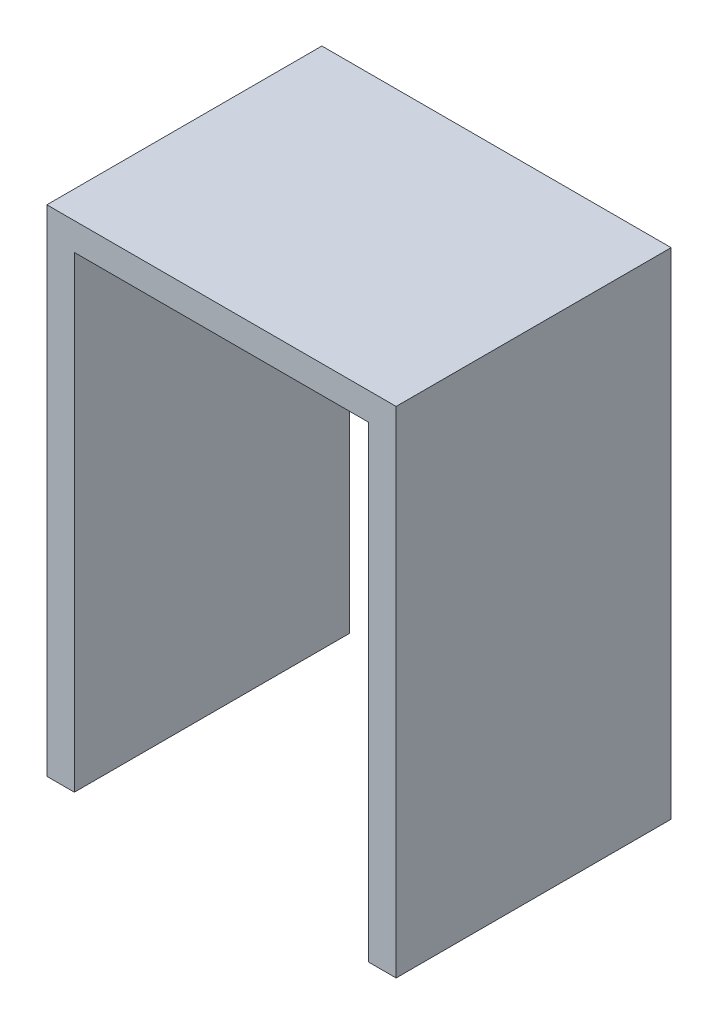
ISO-10303-21;
HEADER;
FILE_DESCRIPTION(('STEP AP214'),'2;1');
FILE_NAME('part.step','',(''),(''),'','','');
FILE_SCHEMA(('AUTOMOTIVE_DESIGN { 1 0 10303 214 1 1 1 1 }'));
ENDSEC;
DATA;
#1=APPLICATION_CONTEXT('core data for automotive mechanical design processes');
#2=APPLICATION_PROTOCOL_DEFINITION('international standard','automotive_design',2000,#1);
#3=PRODUCT_CONTEXT('',#1,'mechanical');
#4=PRODUCT('Part','Part','',(#3));
#5=PRODUCT_RELATED_PRODUCT_CATEGORY('part','',(#4));
#6=PRODUCT_DEFINITION_FORMATION('','',#4);
#7=PRODUCT_DEFINITION_CONTEXT('part definition',#1,'design');
#8=PRODUCT_DEFINITION('design','',#6,#7);
#9=PRODUCT_DEFINITION_SHAPE('','',#8);
#10=(LENGTH_UNIT() NAMED_UNIT(*) SI_UNIT(.MILLI.,.METRE.));
#11=(NAMED_UNIT(*) PLANE_ANGLE_UNIT() SI_UNIT($,.RADIAN.));
#12=(NAMED_UNIT(*) SI_UNIT($,.STERADIAN.) SOLID_ANGLE_UNIT());
#13=UNCERTAINTY_MEASURE_WITH_UNIT(LENGTH_MEASURE(1.E-05),#10,'distance_accuracy_value','');
#14=(GEOMETRIC_REPRESENTATION_CONTEXT(3) GLOBAL_UNCERTAINTY_ASSIGNED_CONTEXT((#13)) GLOBAL_UNIT_ASSIGNED_CONTEXT((#10,
#11,#12)) REPRESENTATION_CONTEXT('',''));
#15=CARTESIAN_POINT('',(0.,0.,0.));
#16=DIRECTION('',(0.,0.,1.));
#17=DIRECTION('',(1.,0.,0.));
#18=AXIS2_PLACEMENT_3D('',#15,#16,#17);
#19=CARTESIAN_POINT('',(-3.33333333333332,0.,10.));
#20=DIRECTION('',(0.,1.,0.));
#21=DIRECTION('',(0.,0.,1.));
#22=AXIS2_PLACEMENT_3D('',#19,#20,#21);
#23=PLANE('',#22);
#24=DIRECTION('',(1.,0.,0.));
#25=VECTOR('',#24,1.);
#26=CARTESIAN_POINT('',(-3.33333333333332,0.,0.));
#27=LINE('',#26,#25);
#28=CARTESIAN_POINT('',(-3.33333333333332,0.,0.));
#29=VERTEX_POINT('',#28);
#30=CARTESIAN_POINT('',(-2.33333333333332,0.,0.));
#31=VERTEX_POINT('',#30);
#32=EDGE_CURVE('E129',#29,#31,#27,.T.);
#33=ORIENTED_EDGE('',*,*,#32,.T.);
#34=DIRECTION('',(0.,0.,-1.));
#35=VECTOR('',#34,1.);
#36=CARTESIAN_POINT('',(-2.33333333333332,0.,10.));
#37=LINE('',#36,#35);
#38=CARTESIAN_POINT('',(-2.33333333333332,0.,10.));
#39=VERTEX_POINT('',#38);
#40=EDGE_CURVE('E11',#39,#31,#37,.T.);
#41=ORIENTED_EDGE('',*,*,#40,.F.);
#42=DIRECTION('',(1.,0.,0.));
#43=VECTOR('',#42,1.);
#44=CARTESIAN_POINT('',(-3.33333333333332,0.,10.));
#45=LINE('',#44,#43);
#46=CARTESIAN_POINT('',(-3.33333333333332,0.,10.));
#47=VERTEX_POINT('',#46);
#48=EDGE_CURVE('E143',#47,#39,#45,.T.);
#49=ORIENTED_EDGE('',*,*,#48,.F.);
#50=DIRECTION('',(0.,0.,-1.));
#51=VECTOR('',#50,1.);
#52=CARTESIAN_POINT('',(-3.33333333333332,0.,10.));
#53=LINE('',#52,#51);
#54=EDGE_CURVE('E125',#47,#29,#53,.T.);
#55=ORIENTED_EDGE('',*,*,#54,.T.);
#56=EDGE_LOOP('',(#33,#41,#49,#55));
#57=FACE_BOUND('',#56,.T.);
#58=ADVANCED_FACE('F33',(#57),#23,.F.);
#59=CARTESIAN_POINT('',(-2.33333333333332,0.,10.));
#60=DIRECTION('',(-1.,0.,0.));
#61=DIRECTION('',(0.,-1.,0.));
#62=AXIS2_PLACEMENT_3D('',#59,#60,#61);
#63=PLANE('',#62);
#64=DIRECTION('',(0.,1.,0.));
#65=VECTOR('',#64,1.);
#66=CARTESIAN_POINT('',(-2.33333333333332,0.,0.));
#67=LINE('',#66,#65);
#68=CARTESIAN_POINT('',(-2.33333333333332,17.,0.));
#69=VERTEX_POINT('',#68);
#70=EDGE_CURVE('E132',#31,#69,#67,.T.);
#71=ORIENTED_EDGE('',*,*,#70,.T.);
#72=DIRECTION('',(0.,0.,-1.));
#73=VECTOR('',#72,1.);
#74=CARTESIAN_POINT('',(-2.33333333333332,17.,10.));
#75=LINE('',#74,#73);
#76=CARTESIAN_POINT('',(-2.33333333333332,17.,10.));
#77=VERTEX_POINT('',#76);
#78=EDGE_CURVE('E41',#77,#69,#75,.T.);
#79=ORIENTED_EDGE('',*,*,#78,.F.);
#80=DIRECTION('',(0.,1.,0.));
#81=VECTOR('',#80,1.);
#82=CARTESIAN_POINT('',(-2.33333333333332,0.,10.));
#83=LINE('',#82,#81);
#84=EDGE_CURVE('E92',#39,#77,#83,.T.);
#85=ORIENTED_EDGE('',*,*,#84,.F.);
#86=ORIENTED_EDGE('',*,*,#40,.T.);
#87=EDGE_LOOP('',(#71,#79,#85,#86));
#88=FACE_BOUND('',#87,.T.);
#89=ADVANCED_FACE('F178',(#88),#63,.F.);
#90=CARTESIAN_POINT('',(-2.33333333333332,17.,10.));
#91=DIRECTION('',(0.,1.,0.));
#92=DIRECTION('',(0.,0.,1.));
#93=AXIS2_PLACEMENT_3D('',#90,#91,#92);
#94=PLANE('',#93);
#95=DIRECTION('',(1.,0.,0.));
#96=VECTOR('',#95,1.);
#97=CARTESIAN_POINT('',(-2.33333333333332,17.,0.));
#98=LINE('',#97,#96);
#99=CARTESIAN_POINT('',(8.36666666666668,17.,0.));
#100=VERTEX_POINT('',#99);
#101=EDGE_CURVE('E134',#69,#100,#98,.T.);
#102=ORIENTED_EDGE('',*,*,#101,.T.);
#103=DIRECTION('',(0.,0.,-1.));
#104=VECTOR('',#103,1.);
#105=CARTESIAN_POINT('',(8.36666666666668,17.,10.));
#106=LINE('',#105,#104);
#107=CARTESIAN_POINT('',(8.36666666666668,17.,10.));
#108=VERTEX_POINT('',#107);
#109=EDGE_CURVE('E150',#108,#100,#106,.T.);
#110=ORIENTED_EDGE('',*,*,#109,.F.);
#111=DIRECTION('',(1.,0.,0.));
#112=VECTOR('',#111,1.);
#113=CARTESIAN_POINT('',(-2.33333333333332,17.,10.));
#114=LINE('',#113,#112);
#115=EDGE_CURVE('E158',#77,#108,#114,.T.);
#116=ORIENTED_EDGE('',*,*,#115,.F.);
#117=ORIENTED_EDGE('',*,*,#78,.T.);
#118=EDGE_LOOP('',(#102,#110,#116,#117));
#119=FACE_BOUND('',#118,.T.);
#120=ADVANCED_FACE('F156',(#119),#94,.F.);
#121=CARTESIAN_POINT('',(8.36666666666668,17.,10.));
#122=DIRECTION('',(1.,0.,0.));
#123=DIRECTION('',(0.,1.,0.));
#124=AXIS2_PLACEMENT_3D('',#121,#122,#123);
#125=PLANE('',#124);
#126=DIRECTION('',(0.,-1.,0.));
#127=VECTOR('',#126,1.);
#128=CARTESIAN_POINT('',(8.36666666666668,17.,0.));
#129=LINE('',#128,#127);
#130=CARTESIAN_POINT('',(8.36666666666668,0.,0.));
#131=VERTEX_POINT('',#130);
#132=EDGE_CURVE('E136',#100,#131,#129,.T.);
#133=ORIENTED_EDGE('',*,*,#132,.T.);
#134=DIRECTION('',(0.,0.,-1.));
#135=VECTOR('',#134,1.);
#136=CARTESIAN_POINT('',(8.36666666666668,0.,10.));
#137=LINE('',#136,#135);
#138=CARTESIAN_POINT('',(8.36666666666668,0.,10.));
#139=VERTEX_POINT('',#138);
#140=EDGE_CURVE('E147',#139,#131,#137,.T.);
#141=ORIENTED_EDGE('',*,*,#140,.F.);
#142=DIRECTION('',(0.,-1.,0.));
#143=VECTOR('',#142,1.);
#144=CARTESIAN_POINT('',(8.36666666666668,17.,10.));
#145=LINE('',#144,#143);
#146=EDGE_CURVE('E170',#108,#139,#145,.T.);
#147=ORIENTED_EDGE('',*,*,#146,.F.);
#148=ORIENTED_EDGE('',*,*,#109,.T.);
#149=EDGE_LOOP('',(#133,#141,#147,#148));
#150=FACE_BOUND('',#149,.T.);
#151=ADVANCED_FACE('F166',(#150),#125,.F.);
#152=CARTESIAN_POINT('',(8.36666666666668,0.,10.));
#153=DIRECTION('',(0.,1.,0.));
#154=DIRECTION('',(0.,0.,1.));
#155=AXIS2_PLACEMENT_3D('',#152,#153,#154);
#156=PLANE('',#155);
#157=DIRECTION('',(1.,0.,0.));
#158=VECTOR('',#157,1.);
#159=CARTESIAN_POINT('',(8.36666666666668,0.,0.));
#160=LINE('',#159,#158);
#161=CARTESIAN_POINT('',(9.36666666666668,0.,0.));
#162=VERTEX_POINT('',#161);
#163=EDGE_CURVE('E138',#131,#162,#160,.T.);
#164=ORIENTED_EDGE('',*,*,#163,.T.);
#165=DIRECTION('',(0.,0.,-1.));
#166=VECTOR('',#165,1.);
#167=CARTESIAN_POINT('',(9.36666666666668,0.,10.));
#168=LINE('',#167,#166);
#169=CARTESIAN_POINT('',(9.36666666666668,0.,10.));
#170=VERTEX_POINT('',#169);
#171=EDGE_CURVE('E120',#170,#162,#168,.T.);
#172=ORIENTED_EDGE('',*,*,#171,.F.);
#173=DIRECTION('',(1.,0.,0.));
#174=VECTOR('',#173,1.);
#175=CARTESIAN_POINT('',(8.36666666666668,0.,10.));
#176=LINE('',#175,#174);
#177=EDGE_CURVE('E111',#139,#170,#176,.T.);
#178=ORIENTED_EDGE('',*,*,#177,.F.);
#179=ORIENTED_EDGE('',*,*,#140,.T.);
#180=EDGE_LOOP('',(#164,#172,#178,#179));
#181=FACE_BOUND('',#180,.T.);
#182=ADVANCED_FACE('F169',(#181),#156,.F.);
#183=CARTESIAN_POINT('',(9.36666666666668,0.,10.));
#184=DIRECTION('',(-1.,0.,0.));
#185=DIRECTION('',(0.,0.,1.));
#186=AXIS2_PLACEMENT_3D('',#183,#184,#185);
#187=PLANE('',#186);
#188=DIRECTION('',(0.,1.,0.));
#189=VECTOR('',#188,1.);
#190=CARTESIAN_POINT('',(9.36666666666668,0.,0.));
#191=LINE('',#190,#189);
#192=CARTESIAN_POINT('',(9.36666666666668,18.,0.));
#193=VERTEX_POINT('',#192);
#194=EDGE_CURVE('E119',#162,#193,#191,.T.);
#195=ORIENTED_EDGE('',*,*,#194,.T.);
#196=DIRECTION('',(0.,0.,-1.));
#197=VECTOR('',#196,1.);
#198=CARTESIAN_POINT('',(9.36666666666668,18.,10.));
#199=LINE('',#198,#197);
#200=CARTESIAN_POINT('',(9.36666666666668,18.,10.));
#201=VERTEX_POINT('',#200);
#202=EDGE_CURVE('E116',#201,#193,#199,.T.);
#203=ORIENTED_EDGE('',*,*,#202,.F.);
#204=DIRECTION('',(0.,1.,0.));
#205=VECTOR('',#204,1.);
#206=CARTESIAN_POINT('',(9.36666666666668,0.,10.));
#207=LINE('',#206,#205);
#208=EDGE_CURVE('E105',#170,#201,#207,.T.);
#209=ORIENTED_EDGE('',*,*,#208,.F.);
#210=ORIENTED_EDGE('',*,*,#171,.T.);
#211=EDGE_LOOP('',(#195,#203,#209,#210));
#212=FACE_BOUND('',#211,.T.);
#213=ADVANCED_FACE('F117',(#212),#187,.F.);
#214=CARTESIAN_POINT('',(9.36666666666668,18.,10.));
#215=DIRECTION('',(0.,-1.,0.));
#216=DIRECTION('',(0.,0.,-1.));
#217=AXIS2_PLACEMENT_3D('',#214,#215,#216);
#218=PLANE('',#217);
#219=DIRECTION('',(-1.,0.,0.));
#220=VECTOR('',#219,1.);
#221=CARTESIAN_POINT('',(9.36666666666668,18.,0.));
#222=LINE('',#221,#220);
#223=CARTESIAN_POINT('',(-3.33333333333332,18.,0.));
#224=VERTEX_POINT('',#223);
#225=EDGE_CURVE('E78',#193,#224,#222,.T.);
#226=ORIENTED_EDGE('',*,*,#225,.T.);
#227=DIRECTION('',(0.,0.,-1.));
#228=VECTOR('',#227,1.);
#229=CARTESIAN_POINT('',(-3.33333333333332,18.,10.));
#230=LINE('',#229,#228);
#231=CARTESIAN_POINT('',(-3.33333333333332,18.,10.));
#232=VERTEX_POINT('',#231);
#233=EDGE_CURVE('E121',#232,#224,#230,.T.);
#234=ORIENTED_EDGE('',*,*,#233,.F.);
#235=DIRECTION('',(-1.,0.,0.));
#236=VECTOR('',#235,1.);
#237=CARTESIAN_POINT('',(9.36666666666668,18.,10.));
#238=LINE('',#237,#236);
#239=EDGE_CURVE('E109',#201,#232,#238,.T.);
#240=ORIENTED_EDGE('',*,*,#239,.F.);
#241=ORIENTED_EDGE('',*,*,#202,.T.);
#242=EDGE_LOOP('',(#226,#234,#240,#241));
#243=FACE_BOUND('',#242,.T.);
#244=ADVANCED_FACE('F123',(#243),#218,.F.);
#245=CARTESIAN_POINT('',(-3.33333333333332,18.,10.));
#246=DIRECTION('',(1.,0.,0.));
#247=DIRECTION('',(0.,1.,0.));
#248=AXIS2_PLACEMENT_3D('',#245,#246,#247);
#249=PLANE('',#248);
#250=DIRECTION('',(0.,-1.,0.));
#251=VECTOR('',#250,1.);
#252=CARTESIAN_POINT('',(-3.33333333333332,18.,0.));
#253=LINE('',#252,#251);
#254=EDGE_CURVE('E84',#224,#29,#253,.T.);
#255=ORIENTED_EDGE('',*,*,#254,.T.);
#256=ORIENTED_EDGE('',*,*,#54,.F.);
#257=DIRECTION('',(0.,-1.,0.));
#258=VECTOR('',#257,1.);
#259=CARTESIAN_POINT('',(-3.33333333333332,18.,10.));
#260=LINE('',#259,#258);
#261=EDGE_CURVE('E49',#232,#47,#260,.T.);
#262=ORIENTED_EDGE('',*,*,#261,.F.);
#263=ORIENTED_EDGE('',*,*,#233,.T.);
#264=EDGE_LOOP('',(#255,#256,#262,#263));
#265=FACE_BOUND('',#264,.T.);
#266=ADVANCED_FACE('F194',(#265),#249,.F.);
#267=CARTESIAN_POINT('',(0.,0.,10.));
#268=DIRECTION('',(0.,0.,1.));
#269=DIRECTION('',(1.,0.,0.));
#270=AXIS2_PLACEMENT_3D('',#267,#268,#269);
#271=PLANE('',#270);
#272=ORIENTED_EDGE('',*,*,#48,.T.);
#273=ORIENTED_EDGE('',*,*,#84,.T.);
#274=ORIENTED_EDGE('',*,*,#115,.T.);
#275=ORIENTED_EDGE('',*,*,#146,.T.);
#276=ORIENTED_EDGE('',*,*,#177,.T.);
#277=ORIENTED_EDGE('',*,*,#208,.T.);
#278=ORIENTED_EDGE('',*,*,#239,.T.);
#279=ORIENTED_EDGE('',*,*,#261,.T.);
#280=EDGE_LOOP('',(#272,#273,#274,#275,#276,#277,#278,#279));
#281=FACE_BOUND('',#280,.T.);
#282=ADVANCED_FACE('F107',(#281),#271,.T.);
#283=CARTESIAN_POINT('',(0.,0.,0.));
#284=DIRECTION('',(0.,0.,1.));
#285=DIRECTION('',(1.,0.,0.));
#286=AXIS2_PLACEMENT_3D('',#283,#284,#285);
#287=PLANE('',#286);
#288=ORIENTED_EDGE('',*,*,#32,.F.);
#289=ORIENTED_EDGE('',*,*,#254,.F.);
#290=ORIENTED_EDGE('',*,*,#225,.F.);
#291=ORIENTED_EDGE('',*,*,#194,.F.);
#292=ORIENTED_EDGE('',*,*,#163,.F.);
#293=ORIENTED_EDGE('',*,*,#132,.F.);
#294=ORIENTED_EDGE('',*,*,#101,.F.);
#295=ORIENTED_EDGE('',*,*,#70,.F.);
#296=EDGE_LOOP('',(#288,#289,#290,#291,#292,#293,#294,#295));
#297=FACE_BOUND('',#296,.T.);
#298=ADVANCED_FACE('F162',(#297),#287,.F.);
#299=CLOSED_SHELL('',(#58,#89,#120,#151,#182,#213,#244,#266,#282,#298));
#300=MANIFOLD_SOLID_BREP('B2',#299);
#301=ADVANCED_BREP_SHAPE_REPRESENTATION('',(#18,#300),#14);
#302=SHAPE_DEFINITION_REPRESENTATION(#9,#301);
ENDSEC;
END-ISO-10303-21;
